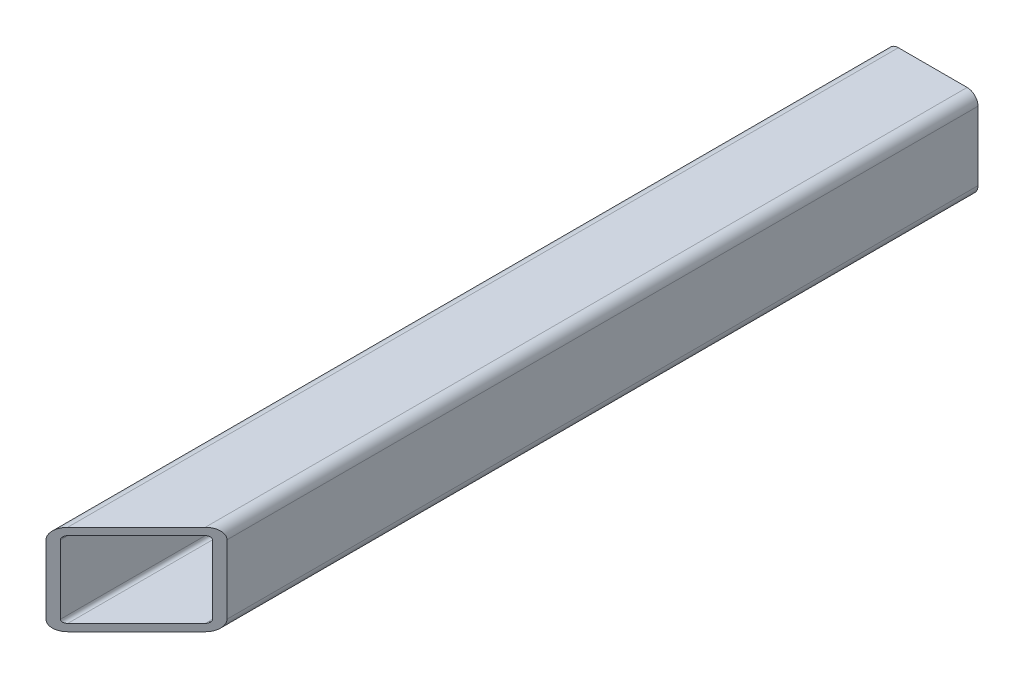
ISO-10303-21;
HEADER;
FILE_DESCRIPTION(('STEP AP214'),'2;1');
FILE_NAME('part.step','',(''),(''),'','','');
FILE_SCHEMA(('AUTOMOTIVE_DESIGN { 1 0 10303 214 1 1 1 1 }'));
ENDSEC;
DATA;
#1=APPLICATION_CONTEXT('core data for automotive mechanical design processes');
#2=APPLICATION_PROTOCOL_DEFINITION('international standard','automotive_design',2000,#1);
#3=PRODUCT_CONTEXT('',#1,'mechanical');
#4=PRODUCT('Part','Part','',(#3));
#5=PRODUCT_RELATED_PRODUCT_CATEGORY('part','',(#4));
#6=PRODUCT_DEFINITION_FORMATION('','',#4);
#7=PRODUCT_DEFINITION_CONTEXT('part definition',#1,'design');
#8=PRODUCT_DEFINITION('design','',#6,#7);
#9=PRODUCT_DEFINITION_SHAPE('','',#8);
#10=(LENGTH_UNIT() NAMED_UNIT(*) SI_UNIT(.MILLI.,.METRE.));
#11=(NAMED_UNIT(*) PLANE_ANGLE_UNIT() SI_UNIT($,.RADIAN.));
#12=(NAMED_UNIT(*) SI_UNIT($,.STERADIAN.) SOLID_ANGLE_UNIT());
#13=UNCERTAINTY_MEASURE_WITH_UNIT(LENGTH_MEASURE(1.E-05),#10,'distance_accuracy_value','');
#14=(GEOMETRIC_REPRESENTATION_CONTEXT(3) GLOBAL_UNCERTAINTY_ASSIGNED_CONTEXT((#13)) GLOBAL_UNIT_ASSIGNED_CONTEXT((#10,
#11,#12)) REPRESENTATION_CONTEXT('',''));
#15=CARTESIAN_POINT('',(0.,0.,0.));
#16=DIRECTION('',(0.,0.,1.));
#17=DIRECTION('',(1.,0.,0.));
#18=AXIS2_PLACEMENT_3D('',#15,#16,#17);
#19=CARTESIAN_POINT('',(0.,0.,0.));
#20=DIRECTION('',(0.,0.,1.));
#21=DIRECTION('',(1.,0.,0.));
#22=AXIS2_PLACEMENT_3D('',#19,#20,#21);
#23=PLANE('',#22);
#24=DIRECTION('',(0.,1.,0.));
#25=VECTOR('',#24,1.);
#26=CARTESIAN_POINT('',(-12.5,-4.75,0.));
#27=LINE('',#26,#25);
#28=CARTESIAN_POINT('',(-12.5,-9.5,0.));
#29=VERTEX_POINT('',#28);
#30=CARTESIAN_POINT('',(-12.5,9.5,0.));
#31=VERTEX_POINT('',#30);
#32=EDGE_CURVE('E11',#29,#31,#27,.T.);
#33=ORIENTED_EDGE('',*,*,#32,.T.);
#34=CARTESIAN_POINT('',(-9.5,9.5,0.));
#35=DIRECTION('',(0.,0.,-1.));
#36=DIRECTION('',(0.,-1.,0.));
#37=AXIS2_PLACEMENT_3D('',#34,#35,#36);
#38=CIRCLE('',#37,3.);
#39=CARTESIAN_POINT('',(-9.5,12.5,0.));
#40=VERTEX_POINT('',#39);
#41=EDGE_CURVE('E267',#31,#40,#38,.T.);
#42=ORIENTED_EDGE('',*,*,#41,.T.);
#43=DIRECTION('',(1.,0.,0.));
#44=VECTOR('',#43,1.);
#45=CARTESIAN_POINT('',(-4.75,12.5,0.));
#46=LINE('',#45,#44);
#47=CARTESIAN_POINT('',(9.5,12.5,0.));
#48=VERTEX_POINT('',#47);
#49=EDGE_CURVE('E192',#40,#48,#46,.T.);
#50=ORIENTED_EDGE('',*,*,#49,.T.);
#51=CARTESIAN_POINT('',(9.5,9.5,0.));
#52=DIRECTION('',(0.,0.,-1.));
#53=DIRECTION('',(-1.,0.,0.));
#54=AXIS2_PLACEMENT_3D('',#51,#52,#53);
#55=CIRCLE('',#54,3.);
#56=CARTESIAN_POINT('',(12.5,9.5,0.));
#57=VERTEX_POINT('',#56);
#58=EDGE_CURVE('E178',#48,#57,#55,.T.);
#59=ORIENTED_EDGE('',*,*,#58,.T.);
#60=DIRECTION('',(0.,-1.,0.));
#61=VECTOR('',#60,1.);
#62=CARTESIAN_POINT('',(12.5,4.75,0.));
#63=LINE('',#62,#61);
#64=CARTESIAN_POINT('',(12.5,-9.5,0.));
#65=VERTEX_POINT('',#64);
#66=EDGE_CURVE('E146',#57,#65,#63,.T.);
#67=ORIENTED_EDGE('',*,*,#66,.T.);
#68=CARTESIAN_POINT('',(9.5,-9.5,0.));
#69=DIRECTION('',(0.,0.,-1.));
#70=DIRECTION('',(0.,1.,0.));
#71=AXIS2_PLACEMENT_3D('',#68,#69,#70);
#72=CIRCLE('',#71,3.);
#73=CARTESIAN_POINT('',(9.5,-12.5,0.));
#74=VERTEX_POINT('',#73);
#75=EDGE_CURVE('E126',#65,#74,#72,.T.);
#76=ORIENTED_EDGE('',*,*,#75,.T.);
#77=DIRECTION('',(-1.,0.,0.));
#78=VECTOR('',#77,1.);
#79=CARTESIAN_POINT('',(4.75,-12.5,0.));
#80=LINE('',#79,#78);
#81=CARTESIAN_POINT('',(-9.5,-12.5,0.));
#82=VERTEX_POINT('',#81);
#83=EDGE_CURVE('E133',#74,#82,#80,.T.);
#84=ORIENTED_EDGE('',*,*,#83,.T.);
#85=CARTESIAN_POINT('',(-9.5,-9.5,0.));
#86=DIRECTION('',(0.,0.,-1.));
#87=DIRECTION('',(1.,0.,0.));
#88=AXIS2_PLACEMENT_3D('',#85,#86,#87);
#89=CIRCLE('',#88,3.);
#90=EDGE_CURVE('E26',#82,#29,#89,.T.);
#91=ORIENTED_EDGE('',*,*,#90,.T.);
#92=EDGE_LOOP('',(#33,#42,#50,#59,#67,#76,#84,#91));
#93=FACE_BOUND('',#92,.T.);
#94=DIRECTION('',(-1.,0.,0.));
#95=VECTOR('',#94,1.);
#96=CARTESIAN_POINT('',(-4.75,10.5,0.));
#97=LINE('',#96,#95);
#98=CARTESIAN_POINT('',(9.5,10.5,0.));
#99=VERTEX_POINT('',#98);
#100=CARTESIAN_POINT('',(-9.5,10.5,0.));
#101=VERTEX_POINT('',#100);
#102=EDGE_CURVE('E213',#99,#101,#97,.T.);
#103=ORIENTED_EDGE('',*,*,#102,.T.);
#104=CARTESIAN_POINT('',(-9.5,9.5,0.));
#105=DIRECTION('',(0.,0.,1.));
#106=DIRECTION('',(0.,-1.,0.));
#107=AXIS2_PLACEMENT_3D('',#104,#105,#106);
#108=CIRCLE('',#107,1.);
#109=CARTESIAN_POINT('',(-10.5,9.5,0.));
#110=VERTEX_POINT('',#109);
#111=EDGE_CURVE('E234',#101,#110,#108,.T.);
#112=ORIENTED_EDGE('',*,*,#111,.T.);
#113=DIRECTION('',(0.,-1.,0.));
#114=VECTOR('',#113,1.);
#115=CARTESIAN_POINT('',(-10.5,-4.75,0.));
#116=LINE('',#115,#114);
#117=CARTESIAN_POINT('',(-10.5,-9.5,0.));
#118=VERTEX_POINT('',#117);
#119=EDGE_CURVE('E107',#110,#118,#116,.T.);
#120=ORIENTED_EDGE('',*,*,#119,.T.);
#121=CARTESIAN_POINT('',(-9.5,-9.5,0.));
#122=DIRECTION('',(0.,0.,1.));
#123=DIRECTION('',(1.,0.,0.));
#124=AXIS2_PLACEMENT_3D('',#121,#122,#123);
#125=CIRCLE('',#124,1.);
#126=CARTESIAN_POINT('',(-9.5,-10.5,0.));
#127=VERTEX_POINT('',#126);
#128=EDGE_CURVE('E93',#118,#127,#125,.T.);
#129=ORIENTED_EDGE('',*,*,#128,.T.);
#130=DIRECTION('',(1.,0.,0.));
#131=VECTOR('',#130,1.);
#132=CARTESIAN_POINT('',(4.75,-10.5,0.));
#133=LINE('',#132,#131);
#134=CARTESIAN_POINT('',(9.5,-10.5,0.));
#135=VERTEX_POINT('',#134);
#136=EDGE_CURVE('E189',#127,#135,#133,.T.);
#137=ORIENTED_EDGE('',*,*,#136,.T.);
#138=CARTESIAN_POINT('',(9.5,-9.5,0.));
#139=DIRECTION('',(0.,0.,1.));
#140=DIRECTION('',(0.,1.,0.));
#141=AXIS2_PLACEMENT_3D('',#138,#139,#140);
#142=CIRCLE('',#141,1.);
#143=CARTESIAN_POINT('',(10.5,-9.5,0.));
#144=VERTEX_POINT('',#143);
#145=EDGE_CURVE('E226',#135,#144,#142,.T.);
#146=ORIENTED_EDGE('',*,*,#145,.T.);
#147=DIRECTION('',(0.,1.,0.));
#148=VECTOR('',#147,1.);
#149=CARTESIAN_POINT('',(10.5,4.75,0.));
#150=LINE('',#149,#148);
#151=CARTESIAN_POINT('',(10.5,9.5,0.));
#152=VERTEX_POINT('',#151);
#153=EDGE_CURVE('E225',#144,#152,#150,.T.);
#154=ORIENTED_EDGE('',*,*,#153,.T.);
#155=CARTESIAN_POINT('',(9.5,9.5,0.));
#156=DIRECTION('',(0.,0.,1.));
#157=DIRECTION('',(-1.,0.,0.));
#158=AXIS2_PLACEMENT_3D('',#155,#156,#157);
#159=CIRCLE('',#158,1.);
#160=EDGE_CURVE('E216',#152,#99,#159,.T.);
#161=ORIENTED_EDGE('',*,*,#160,.T.);
#162=EDGE_LOOP('',(#103,#112,#120,#129,#137,#146,#154,#161));
#163=FACE_BOUND('',#162,.T.);
#164=ADVANCED_FACE('F16',(#93,#163),#23,.F.);
#165=CARTESIAN_POINT('',(-12.5,-9.5,0.));
#166=DIRECTION('',(-1.,0.,0.));
#167=DIRECTION('',(0.,1.,0.));
#168=AXIS2_PLACEMENT_3D('',#165,#166,#167);
#169=PLANE('',#168);
#170=DIRECTION('',(0.,1.,0.));
#171=VECTOR('',#170,1.);
#172=CARTESIAN_POINT('',(-12.5,-4.75,232.5000001));
#173=LINE('',#172,#171);
#174=CARTESIAN_POINT('',(-12.5,-9.5,232.5000001));
#175=VERTEX_POINT('',#174);
#176=CARTESIAN_POINT('',(-12.5,9.5,232.5000001));
#177=VERTEX_POINT('',#176);
#178=EDGE_CURVE('E242',#175,#177,#173,.T.);
#179=ORIENTED_EDGE('',*,*,#178,.T.);
#180=DIRECTION('',(0.,0.,1.));
#181=VECTOR('',#180,1.);
#182=CARTESIAN_POINT('',(-12.5,9.5,0.));
#183=LINE('',#182,#181);
#184=EDGE_CURVE('E204',#31,#177,#183,.T.);
#185=ORIENTED_EDGE('',*,*,#184,.F.);
#186=ORIENTED_EDGE('',*,*,#32,.F.);
#187=DIRECTION('',(0.,0.,1.));
#188=VECTOR('',#187,1.);
#189=CARTESIAN_POINT('',(-12.5,-9.5,0.));
#190=LINE('',#189,#188);
#191=EDGE_CURVE('E142',#29,#175,#190,.T.);
#192=ORIENTED_EDGE('',*,*,#191,.T.);
#193=EDGE_LOOP('',(#179,#185,#186,#192));
#194=FACE_BOUND('',#193,.T.);
#195=ADVANCED_FACE('F464',(#194),#169,.T.);
#196=CARTESIAN_POINT('',(-9.5,-9.5,0.));
#197=DIRECTION('',(0.,0.,1.));
#198=DIRECTION('',(1.,0.,0.));
#199=AXIS2_PLACEMENT_3D('',#196,#197,#198);
#200=CYLINDRICAL_SURFACE('',#199,3.);
#201=CARTESIAN_POINT('',(-9.5,-9.5,229.500000000947));
#202=DIRECTION('',(-0.707106781186548,0.,-0.707106781186547));
#203=DIRECTION('',(0.707106781186547,0.,-0.707106781186548));
#204=AXIS2_PLACEMENT_3D('',#201,#202,#203);
#205=ELLIPSE('',#204,4.24264068711929,3.);
#206=CARTESIAN_POINT('',(-9.5,-12.5,229.500000000947));
#207=VERTEX_POINT('',#206);
#208=EDGE_CURVE('E246',#207,#175,#205,.T.);
#209=ORIENTED_EDGE('',*,*,#208,.T.);
#210=ORIENTED_EDGE('',*,*,#191,.F.);
#211=ORIENTED_EDGE('',*,*,#90,.F.);
#212=DIRECTION('',(0.,0.,1.));
#213=VECTOR('',#212,1.);
#214=CARTESIAN_POINT('',(-9.5,-12.5,0.));
#215=LINE('',#214,#213);
#216=EDGE_CURVE('E139',#82,#207,#215,.T.);
#217=ORIENTED_EDGE('',*,*,#216,.T.);
#218=EDGE_LOOP('',(#209,#210,#211,#217));
#219=FACE_BOUND('',#218,.T.);
#220=ADVANCED_FACE('F459',(#219),#200,.T.);
#221=CARTESIAN_POINT('',(9.5,-12.5,0.));
#222=DIRECTION('',(0.,-1.,0.));
#223=DIRECTION('',(0.,0.,-1.));
#224=AXIS2_PLACEMENT_3D('',#221,#222,#223);
#225=PLANE('',#224);
#226=DIRECTION('',(-0.707106781186547,0.,0.707106781186548));
#227=VECTOR('',#226,1.);
#228=CARTESIAN_POINT('',(112.375000000473,-12.5,107.625000000473));
#229=LINE('',#228,#227);
#230=CARTESIAN_POINT('',(9.5,-12.5,210.500000000947));
#231=VERTEX_POINT('',#230);
#232=EDGE_CURVE('E252',#231,#207,#229,.T.);
#233=ORIENTED_EDGE('',*,*,#232,.T.);
#234=ORIENTED_EDGE('',*,*,#216,.F.);
#235=ORIENTED_EDGE('',*,*,#83,.F.);
#236=DIRECTION('',(0.,0.,1.));
#237=VECTOR('',#236,1.);
#238=CARTESIAN_POINT('',(9.5,-12.5,0.));
#239=LINE('',#238,#237);
#240=EDGE_CURVE('E136',#74,#231,#239,.T.);
#241=ORIENTED_EDGE('',*,*,#240,.T.);
#242=EDGE_LOOP('',(#233,#234,#235,#241));
#243=FACE_BOUND('',#242,.T.);
#244=ADVANCED_FACE('F135',(#243),#225,.T.);
#245=CARTESIAN_POINT('',(9.5,-9.5,0.));
#246=DIRECTION('',(0.,0.,1.));
#247=DIRECTION('',(0.,1.,0.));
#248=AXIS2_PLACEMENT_3D('',#245,#246,#247);
#249=CYLINDRICAL_SURFACE('',#248,3.);
#250=CARTESIAN_POINT('',(9.5,-9.5,210.500000000947));
#251=DIRECTION('',(-0.707106781186548,0.,-0.707106781186547));
#252=DIRECTION('',(-0.707106781186547,0.,0.707106781186548));
#253=AXIS2_PLACEMENT_3D('',#250,#251,#252);
#254=ELLIPSE('',#253,4.24264068711929,3.);
#255=CARTESIAN_POINT('',(12.5,-9.5,207.500000000947));
#256=VERTEX_POINT('',#255);
#257=EDGE_CURVE('E152',#256,#231,#254,.T.);
#258=ORIENTED_EDGE('',*,*,#257,.T.);
#259=ORIENTED_EDGE('',*,*,#240,.F.);
#260=ORIENTED_EDGE('',*,*,#75,.F.);
#261=DIRECTION('',(0.,0.,1.));
#262=VECTOR('',#261,1.);
#263=CARTESIAN_POINT('',(12.5,-9.5,0.));
#264=LINE('',#263,#262);
#265=EDGE_CURVE('E160',#65,#256,#264,.T.);
#266=ORIENTED_EDGE('',*,*,#265,.T.);
#267=EDGE_LOOP('',(#258,#259,#260,#266));
#268=FACE_BOUND('',#267,.T.);
#269=ADVANCED_FACE('F150',(#268),#249,.T.);
#270=CARTESIAN_POINT('',(12.5,9.5,0.));
#271=DIRECTION('',(1.,0.,0.));
#272=DIRECTION('',(0.,1.,0.));
#273=AXIS2_PLACEMENT_3D('',#270,#271,#272);
#274=PLANE('',#273);
#275=DIRECTION('',(0.,-1.,0.));
#276=VECTOR('',#275,1.);
#277=CARTESIAN_POINT('',(12.5,4.75,207.500000000947));
#278=LINE('',#277,#276);
#279=CARTESIAN_POINT('',(12.5,9.5,207.500000000947));
#280=VERTEX_POINT('',#279);
#281=EDGE_CURVE('E208',#280,#256,#278,.T.);
#282=ORIENTED_EDGE('',*,*,#281,.T.);
#283=ORIENTED_EDGE('',*,*,#265,.F.);
#284=ORIENTED_EDGE('',*,*,#66,.F.);
#285=DIRECTION('',(0.,0.,1.));
#286=VECTOR('',#285,1.);
#287=CARTESIAN_POINT('',(12.5,9.5,0.));
#288=LINE('',#287,#286);
#289=EDGE_CURVE('E181',#57,#280,#288,.T.);
#290=ORIENTED_EDGE('',*,*,#289,.T.);
#291=EDGE_LOOP('',(#282,#283,#284,#290));
#292=FACE_BOUND('',#291,.T.);
#293=ADVANCED_FACE('F518',(#292),#274,.T.);
#294=CARTESIAN_POINT('',(9.5,9.5,0.));
#295=DIRECTION('',(0.,0.,1.));
#296=DIRECTION('',(-1.,0.,0.));
#297=AXIS2_PLACEMENT_3D('',#294,#295,#296);
#298=CYLINDRICAL_SURFACE('',#297,1.);
#299=CARTESIAN_POINT('',(9.5,9.5,210.500000000947));
#300=DIRECTION('',(0.707106781186548,0.,0.707106781186547));
#301=DIRECTION('',(-0.707106781186547,0.,0.707106781186548));
#302=AXIS2_PLACEMENT_3D('',#299,#300,#301);
#303=ELLIPSE('',#302,1.4142135623731,1.);
#304=CARTESIAN_POINT('',(10.5,9.5,209.500000000947));
#305=VERTEX_POINT('',#304);
#306=CARTESIAN_POINT('',(9.5,10.5,210.500000000947));
#307=VERTEX_POINT('',#306);
#308=EDGE_CURVE('E174',#305,#307,#303,.T.);
#309=ORIENTED_EDGE('',*,*,#308,.T.);
#310=DIRECTION('',(0.,0.,1.));
#311=VECTOR('',#310,1.);
#312=CARTESIAN_POINT('',(9.5,10.5,0.));
#313=LINE('',#312,#311);
#314=EDGE_CURVE('E209',#99,#307,#313,.T.);
#315=ORIENTED_EDGE('',*,*,#314,.F.);
#316=ORIENTED_EDGE('',*,*,#160,.F.);
#317=DIRECTION('',(0.,0.,1.));
#318=VECTOR('',#317,1.);
#319=CARTESIAN_POINT('',(10.5,9.5,0.));
#320=LINE('',#319,#318);
#321=EDGE_CURVE('E222',#152,#305,#320,.T.);
#322=ORIENTED_EDGE('',*,*,#321,.T.);
#323=EDGE_LOOP('',(#309,#315,#316,#322));
#324=FACE_BOUND('',#323,.T.);
#325=ADVANCED_FACE('F405',(#324),#298,.F.);
#326=CARTESIAN_POINT('',(10.5,9.5,0.));
#327=DIRECTION('',(1.,0.,0.));
#328=DIRECTION('',(0.,-1.,0.));
#329=AXIS2_PLACEMENT_3D('',#326,#327,#328);
#330=PLANE('',#329);
#331=DIRECTION('',(0.,1.,0.));
#332=VECTOR('',#331,1.);
#333=CARTESIAN_POINT('',(10.5,4.75,209.500000000947));
#334=LINE('',#333,#332);
#335=CARTESIAN_POINT('',(10.5,-9.5,209.500000000947));
#336=VERTEX_POINT('',#335);
#337=EDGE_CURVE('E241',#336,#305,#334,.T.);
#338=ORIENTED_EDGE('',*,*,#337,.T.);
#339=ORIENTED_EDGE('',*,*,#321,.F.);
#340=ORIENTED_EDGE('',*,*,#153,.F.);
#341=DIRECTION('',(0.,0.,1.));
#342=VECTOR('',#341,1.);
#343=CARTESIAN_POINT('',(10.5,-9.5,0.));
#344=LINE('',#343,#342);
#345=EDGE_CURVE('E277',#144,#336,#344,.T.);
#346=ORIENTED_EDGE('',*,*,#345,.T.);
#347=EDGE_LOOP('',(#338,#339,#340,#346));
#348=FACE_BOUND('',#347,.T.);
#349=ADVANCED_FACE('F18',(#348),#330,.F.);
#350=CARTESIAN_POINT('',(9.5,-9.5,0.));
#351=DIRECTION('',(0.,0.,1.));
#352=DIRECTION('',(0.,1.,0.));
#353=AXIS2_PLACEMENT_3D('',#350,#351,#352);
#354=CYLINDRICAL_SURFACE('',#353,1.);
#355=CARTESIAN_POINT('',(9.5,-9.5,210.500000000947));
#356=DIRECTION('',(0.707106781186548,0.,0.707106781186547));
#357=DIRECTION('',(-0.707106781186547,0.,0.707106781186548));
#358=AXIS2_PLACEMENT_3D('',#355,#356,#357);
#359=ELLIPSE('',#358,1.4142135623731,1.);
#360=CARTESIAN_POINT('',(9.5,-10.5,210.500000000947));
#361=VERTEX_POINT('',#360);
#362=EDGE_CURVE('E263',#361,#336,#359,.T.);
#363=ORIENTED_EDGE('',*,*,#362,.T.);
#364=ORIENTED_EDGE('',*,*,#345,.F.);
#365=ORIENTED_EDGE('',*,*,#145,.F.);
#366=DIRECTION('',(0.,0.,1.));
#367=VECTOR('',#366,1.);
#368=CARTESIAN_POINT('',(9.5,-10.5,0.));
#369=LINE('',#368,#367);
#370=EDGE_CURVE('E180',#135,#361,#369,.T.);
#371=ORIENTED_EDGE('',*,*,#370,.T.);
#372=EDGE_LOOP('',(#363,#364,#365,#371));
#373=FACE_BOUND('',#372,.T.);
#374=ADVANCED_FACE('F391',(#373),#354,.F.);
#375=CARTESIAN_POINT('',(9.5,-10.5,0.));
#376=DIRECTION('',(0.,-1.,0.));
#377=DIRECTION('',(0.,0.,-1.));
#378=AXIS2_PLACEMENT_3D('',#375,#376,#377);
#379=PLANE('',#378);
#380=DIRECTION('',(0.707106781186547,0.,-0.707106781186548));
#381=VECTOR('',#380,1.);
#382=CARTESIAN_POINT('',(112.375000000473,-10.5,107.625000000473));
#383=LINE('',#382,#381);
#384=CARTESIAN_POINT('',(-9.5,-10.5,229.500000000947));
#385=VERTEX_POINT('',#384);
#386=EDGE_CURVE('E217',#385,#361,#383,.T.);
#387=ORIENTED_EDGE('',*,*,#386,.T.);
#388=ORIENTED_EDGE('',*,*,#370,.F.);
#389=ORIENTED_EDGE('',*,*,#136,.F.);
#390=DIRECTION('',(0.,0.,1.));
#391=VECTOR('',#390,1.);
#392=CARTESIAN_POINT('',(-9.5,-10.5,0.));
#393=LINE('',#392,#391);
#394=EDGE_CURVE('E300',#127,#385,#393,.T.);
#395=ORIENTED_EDGE('',*,*,#394,.T.);
#396=EDGE_LOOP('',(#387,#388,#389,#395));
#397=FACE_BOUND('',#396,.T.);
#398=ADVANCED_FACE('F379',(#397),#379,.F.);
#399=CARTESIAN_POINT('',(9.5,9.5,0.));
#400=DIRECTION('',(0.,0.,1.));
#401=DIRECTION('',(-1.,0.,0.));
#402=AXIS2_PLACEMENT_3D('',#399,#400,#401);
#403=CYLINDRICAL_SURFACE('',#402,3.);
#404=CARTESIAN_POINT('',(9.5,9.5,210.500000000947));
#405=DIRECTION('',(-0.707106781186548,0.,-0.707106781186547));
#406=DIRECTION('',(-0.707106781186547,0.,0.707106781186548));
#407=AXIS2_PLACEMENT_3D('',#404,#405,#406);
#408=ELLIPSE('',#407,4.24264068711929,3.);
#409=CARTESIAN_POINT('',(9.5,12.5,210.500000000947));
#410=VERTEX_POINT('',#409);
#411=EDGE_CURVE('E170',#410,#280,#408,.T.);
#412=ORIENTED_EDGE('',*,*,#411,.T.);
#413=ORIENTED_EDGE('',*,*,#289,.F.);
#414=ORIENTED_EDGE('',*,*,#58,.F.);
#415=DIRECTION('',(0.,0.,1.));
#416=VECTOR('',#415,1.);
#417=CARTESIAN_POINT('',(9.5,12.5,0.));
#418=LINE('',#417,#416);
#419=EDGE_CURVE('E200',#48,#410,#418,.T.);
#420=ORIENTED_EDGE('',*,*,#419,.T.);
#421=EDGE_LOOP('',(#412,#413,#414,#420));
#422=FACE_BOUND('',#421,.T.);
#423=ADVANCED_FACE('F341',(#422),#403,.T.);
#424=CARTESIAN_POINT('',(-9.5,12.5,0.));
#425=DIRECTION('',(0.,1.,0.));
#426=DIRECTION('',(1.,0.,0.));
#427=AXIS2_PLACEMENT_3D('',#424,#425,#426);
#428=PLANE('',#427);
#429=DIRECTION('',(0.707106781186547,0.,-0.707106781186548));
#430=VECTOR('',#429,1.);
#431=CARTESIAN_POINT('',(107.625000000473,12.5,112.375000000473));
#432=LINE('',#431,#430);
#433=CARTESIAN_POINT('',(-9.5,12.5,229.500000000947));
#434=VERTEX_POINT('',#433);
#435=EDGE_CURVE('E165',#434,#410,#432,.T.);
#436=ORIENTED_EDGE('',*,*,#435,.T.);
#437=ORIENTED_EDGE('',*,*,#419,.F.);
#438=ORIENTED_EDGE('',*,*,#49,.F.);
#439=DIRECTION('',(0.,0.,1.));
#440=VECTOR('',#439,1.);
#441=CARTESIAN_POINT('',(-9.5,12.5,0.));
#442=LINE('',#441,#440);
#443=EDGE_CURVE('E271',#40,#434,#442,.T.);
#444=ORIENTED_EDGE('',*,*,#443,.T.);
#445=EDGE_LOOP('',(#436,#437,#438,#444));
#446=FACE_BOUND('',#445,.T.);
#447=ADVANCED_FACE('F321',(#446),#428,.T.);
#448=CARTESIAN_POINT('',(-9.5,9.5,0.));
#449=DIRECTION('',(0.,0.,1.));
#450=DIRECTION('',(0.,-1.,0.));
#451=AXIS2_PLACEMENT_3D('',#448,#449,#450);
#452=CYLINDRICAL_SURFACE('',#451,3.);
#453=CARTESIAN_POINT('',(-9.5,9.5,229.500000000947));
#454=DIRECTION('',(-0.707106781186548,0.,-0.707106781186547));
#455=DIRECTION('',(0.707106781186547,0.,-0.707106781186548));
#456=AXIS2_PLACEMENT_3D('',#453,#454,#455);
#457=ELLIPSE('',#456,4.24264068711929,3.);
#458=EDGE_CURVE('E169',#177,#434,#457,.T.);
#459=ORIENTED_EDGE('',*,*,#458,.T.);
#460=ORIENTED_EDGE('',*,*,#443,.F.);
#461=ORIENTED_EDGE('',*,*,#41,.F.);
#462=ORIENTED_EDGE('',*,*,#184,.T.);
#463=EDGE_LOOP('',(#459,#460,#461,#462));
#464=FACE_BOUND('',#463,.T.);
#465=ADVANCED_FACE('F332',(#464),#452,.T.);
#466=CARTESIAN_POINT('',(-9.5,-9.5,0.));
#467=DIRECTION('',(0.,0.,1.));
#468=DIRECTION('',(1.,0.,0.));
#469=AXIS2_PLACEMENT_3D('',#466,#467,#468);
#470=CYLINDRICAL_SURFACE('',#469,1.);
#471=CARTESIAN_POINT('',(-9.5,-9.5,229.500000000947));
#472=DIRECTION('',(0.707106781186548,0.,0.707106781186547));
#473=DIRECTION('',(0.707106781186547,0.,-0.707106781186548));
#474=AXIS2_PLACEMENT_3D('',#471,#472,#473);
#475=ELLIPSE('',#474,1.4142135623731,1.);
#476=CARTESIAN_POINT('',(-10.5,-9.5,230.500000000947));
#477=VERTEX_POINT('',#476);
#478=EDGE_CURVE('E221',#477,#385,#475,.T.);
#479=ORIENTED_EDGE('',*,*,#478,.T.);
#480=ORIENTED_EDGE('',*,*,#394,.F.);
#481=ORIENTED_EDGE('',*,*,#128,.F.);
#482=DIRECTION('',(0.,0.,1.));
#483=VECTOR('',#482,1.);
#484=CARTESIAN_POINT('',(-10.5,-9.5,0.));
#485=LINE('',#484,#483);
#486=EDGE_CURVE('E253',#118,#477,#485,.T.);
#487=ORIENTED_EDGE('',*,*,#486,.T.);
#488=EDGE_LOOP('',(#479,#480,#481,#487));
#489=FACE_BOUND('',#488,.T.);
#490=ADVANCED_FACE('F384',(#489),#470,.F.);
#491=CARTESIAN_POINT('',(-10.5,-9.5,0.));
#492=DIRECTION('',(-1.,0.,0.));
#493=DIRECTION('',(0.,0.,1.));
#494=AXIS2_PLACEMENT_3D('',#491,#492,#493);
#495=PLANE('',#494);
#496=DIRECTION('',(0.,-1.,0.));
#497=VECTOR('',#496,1.);
#498=CARTESIAN_POINT('',(-10.5,-4.75,230.500000000947));
#499=LINE('',#498,#497);
#500=CARTESIAN_POINT('',(-10.5,9.5,230.500000000947));
#501=VERTEX_POINT('',#500);
#502=EDGE_CURVE('E231',#501,#477,#499,.T.);
#503=ORIENTED_EDGE('',*,*,#502,.T.);
#504=ORIENTED_EDGE('',*,*,#486,.F.);
#505=ORIENTED_EDGE('',*,*,#119,.F.);
#506=DIRECTION('',(0.,0.,1.));
#507=VECTOR('',#506,1.);
#508=CARTESIAN_POINT('',(-10.5,9.5,0.));
#509=LINE('',#508,#507);
#510=EDGE_CURVE('E212',#110,#501,#509,.T.);
#511=ORIENTED_EDGE('',*,*,#510,.T.);
#512=EDGE_LOOP('',(#503,#504,#505,#511));
#513=FACE_BOUND('',#512,.T.);
#514=ADVANCED_FACE('F394',(#513),#495,.F.);
#515=CARTESIAN_POINT('',(-9.5,9.5,0.));
#516=DIRECTION('',(0.,0.,1.));
#517=DIRECTION('',(0.,-1.,0.));
#518=AXIS2_PLACEMENT_3D('',#515,#516,#517);
#519=CYLINDRICAL_SURFACE('',#518,1.);
#520=CARTESIAN_POINT('',(-9.5,9.5,229.500000000947));
#521=DIRECTION('',(0.707106781186548,0.,0.707106781186547));
#522=DIRECTION('',(0.707106781186547,0.,-0.707106781186548));
#523=AXIS2_PLACEMENT_3D('',#520,#521,#522);
#524=ELLIPSE('',#523,1.4142135623731,1.);
#525=CARTESIAN_POINT('',(-9.5,10.5,229.500000000947));
#526=VERTEX_POINT('',#525);
#527=EDGE_CURVE('E175',#526,#501,#524,.T.);
#528=ORIENTED_EDGE('',*,*,#527,.T.);
#529=ORIENTED_EDGE('',*,*,#510,.F.);
#530=ORIENTED_EDGE('',*,*,#111,.F.);
#531=DIRECTION('',(0.,0.,1.));
#532=VECTOR('',#531,1.);
#533=CARTESIAN_POINT('',(-9.5,10.5,0.));
#534=LINE('',#533,#532);
#535=EDGE_CURVE('E256',#101,#526,#534,.T.);
#536=ORIENTED_EDGE('',*,*,#535,.T.);
#537=EDGE_LOOP('',(#528,#529,#530,#536));
#538=FACE_BOUND('',#537,.T.);
#539=ADVANCED_FACE('F398',(#538),#519,.F.);
#540=CARTESIAN_POINT('',(-9.5,10.5,0.));
#541=DIRECTION('',(0.,1.,0.));
#542=DIRECTION('',(1.,0.,0.));
#543=AXIS2_PLACEMENT_3D('',#540,#541,#542);
#544=PLANE('',#543);
#545=DIRECTION('',(-0.707106781186547,0.,0.707106781186548));
#546=VECTOR('',#545,1.);
#547=CARTESIAN_POINT('',(107.625000000473,10.5,112.375000000473));
#548=LINE('',#547,#546);
#549=EDGE_CURVE('E171',#307,#526,#548,.T.);
#550=ORIENTED_EDGE('',*,*,#549,.T.);
#551=ORIENTED_EDGE('',*,*,#535,.F.);
#552=ORIENTED_EDGE('',*,*,#102,.F.);
#553=ORIENTED_EDGE('',*,*,#314,.T.);
#554=EDGE_LOOP('',(#550,#551,#552,#553));
#555=FACE_BOUND('',#554,.T.);
#556=ADVANCED_FACE('F402',(#555),#544,.F.);
#557=CARTESIAN_POINT('',(110.000000000473,0.,110.000000000473));
#558=DIRECTION('',(-0.707106781186548,0.,-0.707106781186547));
#559=DIRECTION('',(-0.707106781186547,0.,0.707106781186548));
#560=AXIS2_PLACEMENT_3D('',#557,#558,#559);
#561=PLANE('',#560);
#562=ORIENTED_EDGE('',*,*,#281,.F.);
#563=ORIENTED_EDGE('',*,*,#411,.F.);
#564=ORIENTED_EDGE('',*,*,#435,.F.);
#565=ORIENTED_EDGE('',*,*,#458,.F.);
#566=ORIENTED_EDGE('',*,*,#178,.F.);
#567=ORIENTED_EDGE('',*,*,#208,.F.);
#568=ORIENTED_EDGE('',*,*,#232,.F.);
#569=ORIENTED_EDGE('',*,*,#257,.F.);
#570=EDGE_LOOP('',(#562,#563,#564,#565,#566,#567,#568,#569));
#571=FACE_BOUND('',#570,.T.);
#572=ORIENTED_EDGE('',*,*,#386,.F.);
#573=ORIENTED_EDGE('',*,*,#478,.F.);
#574=ORIENTED_EDGE('',*,*,#502,.F.);
#575=ORIENTED_EDGE('',*,*,#527,.F.);
#576=ORIENTED_EDGE('',*,*,#549,.F.);
#577=ORIENTED_EDGE('',*,*,#308,.F.);
#578=ORIENTED_EDGE('',*,*,#337,.F.);
#579=ORIENTED_EDGE('',*,*,#362,.F.);
#580=EDGE_LOOP('',(#572,#573,#574,#575,#576,#577,#578,#579));
#581=FACE_BOUND('',#580,.T.);
#582=ADVANCED_FACE('F336',(#571,#581),#561,.F.);
#583=CLOSED_SHELL('',(#164,#195,#220,#244,#269,#293,#325,#349,#374,#398,#423,#447,#465,#490,
#514,#539,#556,#582));
#584=MANIFOLD_SOLID_BREP('B1',#583);
#585=ADVANCED_BREP_SHAPE_REPRESENTATION('',(#18,#584),#14);
#586=SHAPE_DEFINITION_REPRESENTATION(#9,#585);
ENDSEC;
END-ISO-10303-21;
